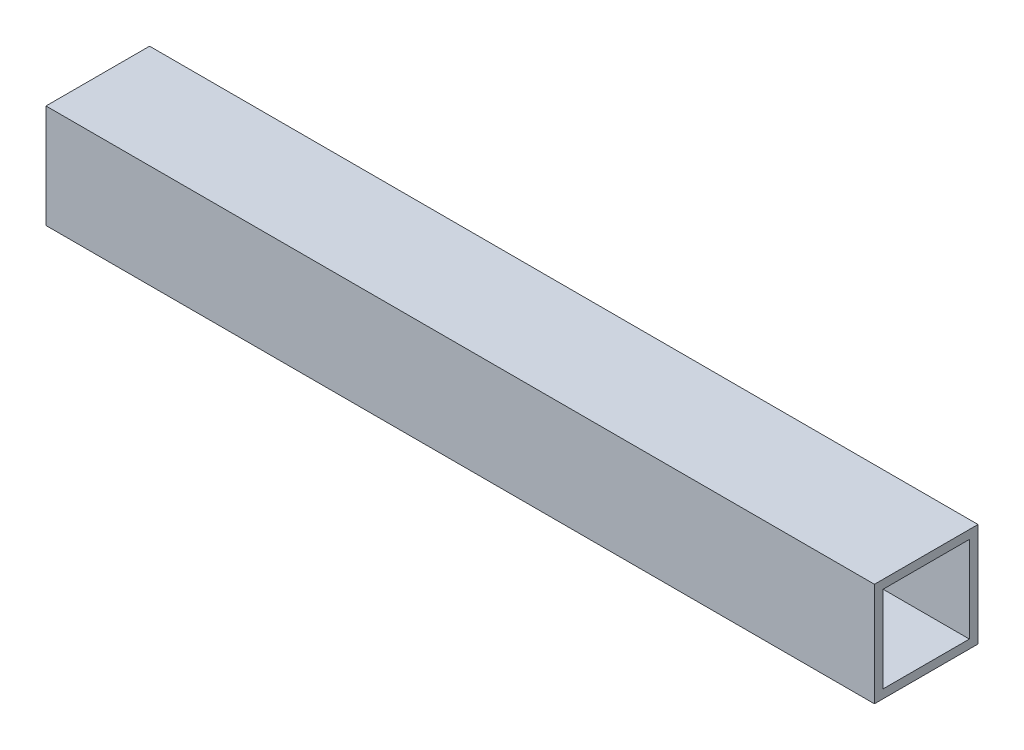
ISO-10303-21;
HEADER;
FILE_DESCRIPTION(('STEP AP214'),'2;1');
FILE_NAME('part.step','',(''),(''),'','','');
FILE_SCHEMA(('AUTOMOTIVE_DESIGN { 1 0 10303 214 1 1 1 1 }'));
ENDSEC;
DATA;
#1=APPLICATION_CONTEXT('core data for automotive mechanical design processes');
#2=APPLICATION_PROTOCOL_DEFINITION('international standard','automotive_design',2000,#1);
#3=PRODUCT_CONTEXT('',#1,'mechanical');
#4=PRODUCT('Part','Part','',(#3));
#5=PRODUCT_RELATED_PRODUCT_CATEGORY('part','',(#4));
#6=PRODUCT_DEFINITION_FORMATION('','',#4);
#7=PRODUCT_DEFINITION_CONTEXT('part definition',#1,'design');
#8=PRODUCT_DEFINITION('design','',#6,#7);
#9=PRODUCT_DEFINITION_SHAPE('','',#8);
#10=(LENGTH_UNIT() NAMED_UNIT(*) SI_UNIT(.MILLI.,.METRE.));
#11=(NAMED_UNIT(*) PLANE_ANGLE_UNIT() SI_UNIT($,.RADIAN.));
#12=(NAMED_UNIT(*) SI_UNIT($,.STERADIAN.) SOLID_ANGLE_UNIT());
#13=UNCERTAINTY_MEASURE_WITH_UNIT(LENGTH_MEASURE(1.E-05),#10,'distance_accuracy_value','');
#14=(GEOMETRIC_REPRESENTATION_CONTEXT(3) GLOBAL_UNCERTAINTY_ASSIGNED_CONTEXT((#13)) GLOBAL_UNIT_ASSIGNED_CONTEXT((#10,
#11,#12)) REPRESENTATION_CONTEXT('',''));
#15=CARTESIAN_POINT('',(0.,0.,0.));
#16=DIRECTION('',(0.,0.,1.));
#17=DIRECTION('',(1.,0.,0.));
#18=AXIS2_PLACEMENT_3D('',#15,#16,#17);
#19=CARTESIAN_POINT('',(-152.4,-19.05,19.05));
#20=DIRECTION('',(0.,-1.,0.));
#21=DIRECTION('',(0.,0.,-1.));
#22=AXIS2_PLACEMENT_3D('',#19,#20,#21);
#23=PLANE('',#22);
#24=DIRECTION('',(1.,0.,0.));
#25=VECTOR('',#24,1.);
#26=CARTESIAN_POINT('',(-152.4,-19.05,19.05));
#27=LINE('',#26,#25);
#28=CARTESIAN_POINT('',(-152.4,-19.05,19.05));
#29=VERTEX_POINT('',#28);
#30=CARTESIAN_POINT('',(152.4,-19.05,19.05));
#31=VERTEX_POINT('',#30);
#32=EDGE_CURVE('E114',#29,#31,#27,.T.);
#33=ORIENTED_EDGE('',*,*,#32,.F.);
#34=DIRECTION('',(0.,0.,-1.));
#35=VECTOR('',#34,1.);
#36=CARTESIAN_POINT('',(-152.4,-19.05,0.));
#37=LINE('',#36,#35);
#38=CARTESIAN_POINT('',(-152.4,-19.05,-19.05));
#39=VERTEX_POINT('',#38);
#40=EDGE_CURVE('E136',#29,#39,#37,.T.);
#41=ORIENTED_EDGE('',*,*,#40,.T.);
#42=DIRECTION('',(-1.,0.,0.));
#43=VECTOR('',#42,1.);
#44=CARTESIAN_POINT('',(-152.4,-19.05,-19.05));
#45=LINE('',#44,#43);
#46=CARTESIAN_POINT('',(152.4,-19.05,-19.05));
#47=VERTEX_POINT('',#46);
#48=EDGE_CURVE('E131',#47,#39,#45,.T.);
#49=ORIENTED_EDGE('',*,*,#48,.F.);
#50=DIRECTION('',(0.,0.,-1.));
#51=VECTOR('',#50,1.);
#52=CARTESIAN_POINT('',(152.4,-19.05,0.));
#53=LINE('',#52,#51);
#54=EDGE_CURVE('E106',#31,#47,#53,.T.);
#55=ORIENTED_EDGE('',*,*,#54,.F.);
#56=EDGE_LOOP('',(#33,#41,#49,#55));
#57=FACE_BOUND('',#56,.T.);
#58=ADVANCED_FACE('F17',(#57),#23,.T.);
#59=CARTESIAN_POINT('',(-152.4,15.875,-15.875));
#60=DIRECTION('',(0.,0.,1.));
#61=DIRECTION('',(1.,0.,0.));
#62=AXIS2_PLACEMENT_3D('',#59,#60,#61);
#63=PLANE('',#62);
#64=DIRECTION('',(1.,0.,0.));
#65=VECTOR('',#64,1.);
#66=CARTESIAN_POINT('',(-152.4,15.875,-15.875));
#67=LINE('',#66,#65);
#68=CARTESIAN_POINT('',(-152.4,15.875,-15.875));
#69=VERTEX_POINT('',#68);
#70=CARTESIAN_POINT('',(152.4,15.875,-15.875));
#71=VERTEX_POINT('',#70);
#72=EDGE_CURVE('E91',#69,#71,#67,.T.);
#73=ORIENTED_EDGE('',*,*,#72,.F.);
#74=DIRECTION('',(0.,1.,0.));
#75=VECTOR('',#74,1.);
#76=CARTESIAN_POINT('',(-152.4,0.,-15.875));
#77=LINE('',#76,#75);
#78=CARTESIAN_POINT('',(-152.4,-15.875,-15.875));
#79=VERTEX_POINT('',#78);
#80=EDGE_CURVE('E139',#69,#79,#77,.F.);
#81=ORIENTED_EDGE('',*,*,#80,.T.);
#82=DIRECTION('',(1.,0.,0.));
#83=VECTOR('',#82,1.);
#84=CARTESIAN_POINT('',(-152.4,-15.875,-15.875));
#85=LINE('',#84,#83);
#86=CARTESIAN_POINT('',(152.4,-15.875,-15.875));
#87=VERTEX_POINT('',#86);
#88=EDGE_CURVE('E20',#87,#79,#85,.F.);
#89=ORIENTED_EDGE('',*,*,#88,.F.);
#90=DIRECTION('',(0.,1.,0.));
#91=VECTOR('',#90,1.);
#92=CARTESIAN_POINT('',(152.4,0.,-15.875));
#93=LINE('',#92,#91);
#94=EDGE_CURVE('E105',#71,#87,#93,.F.);
#95=ORIENTED_EDGE('',*,*,#94,.F.);
#96=EDGE_LOOP('',(#73,#81,#89,#95));
#97=FACE_BOUND('',#96,.T.);
#98=ADVANCED_FACE('F125',(#97),#63,.T.);
#99=CARTESIAN_POINT('',(-152.4,-15.875,-15.875));
#100=DIRECTION('',(0.,1.,0.));
#101=DIRECTION('',(0.,0.,1.));
#102=AXIS2_PLACEMENT_3D('',#99,#100,#101);
#103=PLANE('',#102);
#104=ORIENTED_EDGE('',*,*,#88,.T.);
#105=DIRECTION('',(0.,0.,-1.));
#106=VECTOR('',#105,1.);
#107=CARTESIAN_POINT('',(-152.4,-15.875,0.));
#108=LINE('',#107,#106);
#109=CARTESIAN_POINT('',(-152.4,-15.875,15.875));
#110=VERTEX_POINT('',#109);
#111=EDGE_CURVE('E88',#79,#110,#108,.F.);
#112=ORIENTED_EDGE('',*,*,#111,.T.);
#113=DIRECTION('',(-1.,0.,0.));
#114=VECTOR('',#113,1.);
#115=CARTESIAN_POINT('',(-152.4,-15.875,15.875));
#116=LINE('',#115,#114);
#117=CARTESIAN_POINT('',(152.4,-15.875,15.875));
#118=VERTEX_POINT('',#117);
#119=EDGE_CURVE('E80',#118,#110,#116,.T.);
#120=ORIENTED_EDGE('',*,*,#119,.F.);
#121=DIRECTION('',(0.,0.,-1.));
#122=VECTOR('',#121,1.);
#123=CARTESIAN_POINT('',(152.4,-15.875,0.));
#124=LINE('',#123,#122);
#125=EDGE_CURVE('E85',#87,#118,#124,.F.);
#126=ORIENTED_EDGE('',*,*,#125,.F.);
#127=EDGE_LOOP('',(#104,#112,#120,#126));
#128=FACE_BOUND('',#127,.T.);
#129=ADVANCED_FACE('F83',(#128),#103,.T.);
#130=CARTESIAN_POINT('',(-152.4,-15.875,15.875));
#131=DIRECTION('',(0.,0.,-1.));
#132=DIRECTION('',(-1.,0.,0.));
#133=AXIS2_PLACEMENT_3D('',#130,#131,#132);
#134=PLANE('',#133);
#135=ORIENTED_EDGE('',*,*,#119,.T.);
#136=DIRECTION('',(0.,1.,0.));
#137=VECTOR('',#136,1.);
#138=CARTESIAN_POINT('',(-152.4,0.,15.875));
#139=LINE('',#138,#137);
#140=CARTESIAN_POINT('',(-152.4,15.875,15.875));
#141=VERTEX_POINT('',#140);
#142=EDGE_CURVE('E142',#110,#141,#139,.T.);
#143=ORIENTED_EDGE('',*,*,#142,.T.);
#144=DIRECTION('',(1.,0.,0.));
#145=VECTOR('',#144,1.);
#146=CARTESIAN_POINT('',(-152.4,15.875,15.875));
#147=LINE('',#146,#145);
#148=CARTESIAN_POINT('',(152.4,15.875,15.875));
#149=VERTEX_POINT('',#148);
#150=EDGE_CURVE('E96',#149,#141,#147,.F.);
#151=ORIENTED_EDGE('',*,*,#150,.F.);
#152=DIRECTION('',(0.,1.,0.));
#153=VECTOR('',#152,1.);
#154=CARTESIAN_POINT('',(152.4,0.,15.875));
#155=LINE('',#154,#153);
#156=EDGE_CURVE('E93',#118,#149,#155,.T.);
#157=ORIENTED_EDGE('',*,*,#156,.F.);
#158=EDGE_LOOP('',(#135,#143,#151,#157));
#159=FACE_BOUND('',#158,.T.);
#160=ADVANCED_FACE('F94',(#159),#134,.T.);
#161=CARTESIAN_POINT('',(-152.4,15.875,15.875));
#162=DIRECTION('',(0.,-1.,0.));
#163=DIRECTION('',(0.,0.,-1.));
#164=AXIS2_PLACEMENT_3D('',#161,#162,#163);
#165=PLANE('',#164);
#166=ORIENTED_EDGE('',*,*,#150,.T.);
#167=DIRECTION('',(0.,0.,-1.));
#168=VECTOR('',#167,1.);
#169=CARTESIAN_POINT('',(-152.4,15.875,0.));
#170=LINE('',#169,#168);
#171=EDGE_CURVE('E122',#141,#69,#170,.T.);
#172=ORIENTED_EDGE('',*,*,#171,.T.);
#173=ORIENTED_EDGE('',*,*,#72,.T.);
#174=DIRECTION('',(0.,0.,-1.));
#175=VECTOR('',#174,1.);
#176=CARTESIAN_POINT('',(152.4,15.875,0.));
#177=LINE('',#176,#175);
#178=EDGE_CURVE('E100',#149,#71,#177,.T.);
#179=ORIENTED_EDGE('',*,*,#178,.F.);
#180=EDGE_LOOP('',(#166,#172,#173,#179));
#181=FACE_BOUND('',#180,.T.);
#182=ADVANCED_FACE('F120',(#181),#165,.T.);
#183=CARTESIAN_POINT('',(-152.4,19.05,19.05));
#184=DIRECTION('',(0.,0.,1.));
#185=DIRECTION('',(1.,0.,0.));
#186=AXIS2_PLACEMENT_3D('',#183,#184,#185);
#187=PLANE('',#186);
#188=DIRECTION('',(1.,0.,0.));
#189=VECTOR('',#188,1.);
#190=CARTESIAN_POINT('',(-152.4,19.05,19.05));
#191=LINE('',#190,#189);
#192=CARTESIAN_POINT('',(-152.4,19.05,19.05));
#193=VERTEX_POINT('',#192);
#194=CARTESIAN_POINT('',(152.4,19.05,19.05));
#195=VERTEX_POINT('',#194);
#196=EDGE_CURVE('E145',#193,#195,#191,.T.);
#197=ORIENTED_EDGE('',*,*,#196,.F.);
#198=DIRECTION('',(0.,1.,0.));
#199=VECTOR('',#198,1.);
#200=CARTESIAN_POINT('',(-152.4,0.,19.05));
#201=LINE('',#200,#199);
#202=EDGE_CURVE('E133',#193,#29,#201,.F.);
#203=ORIENTED_EDGE('',*,*,#202,.T.);
#204=ORIENTED_EDGE('',*,*,#32,.T.);
#205=DIRECTION('',(0.,1.,0.));
#206=VECTOR('',#205,1.);
#207=CARTESIAN_POINT('',(152.4,0.,19.05));
#208=LINE('',#207,#206);
#209=EDGE_CURVE('E108',#195,#31,#208,.F.);
#210=ORIENTED_EDGE('',*,*,#209,.F.);
#211=EDGE_LOOP('',(#197,#203,#204,#210));
#212=FACE_BOUND('',#211,.T.);
#213=ADVANCED_FACE('F164',(#212),#187,.T.);
#214=CARTESIAN_POINT('',(152.4,0.,0.));
#215=DIRECTION('',(1.,0.,0.));
#216=DIRECTION('',(0.,0.,-1.));
#217=AXIS2_PLACEMENT_3D('',#214,#215,#216);
#218=PLANE('',#217);
#219=ORIENTED_EDGE('',*,*,#178,.T.);
#220=ORIENTED_EDGE('',*,*,#94,.T.);
#221=ORIENTED_EDGE('',*,*,#125,.T.);
#222=ORIENTED_EDGE('',*,*,#156,.T.);
#223=EDGE_LOOP('',(#219,#220,#221,#222));
#224=FACE_BOUND('',#223,.T.);
#225=DIRECTION('',(0.,1.,0.));
#226=VECTOR('',#225,1.);
#227=CARTESIAN_POINT('',(152.4,-19.05,-19.05));
#228=LINE('',#227,#226);
#229=CARTESIAN_POINT('',(152.4,19.05,-19.05));
#230=VERTEX_POINT('',#229);
#231=EDGE_CURVE('E126',#230,#47,#228,.F.);
#232=ORIENTED_EDGE('',*,*,#231,.F.);
#233=DIRECTION('',(0.,0.,1.));
#234=VECTOR('',#233,1.);
#235=CARTESIAN_POINT('',(152.4,19.05,-19.05));
#236=LINE('',#235,#234);
#237=EDGE_CURVE('E148',#195,#230,#236,.F.);
#238=ORIENTED_EDGE('',*,*,#237,.F.);
#239=ORIENTED_EDGE('',*,*,#209,.T.);
#240=ORIENTED_EDGE('',*,*,#54,.T.);
#241=EDGE_LOOP('',(#232,#238,#239,#240));
#242=FACE_BOUND('',#241,.T.);
#243=ADVANCED_FACE('F102',(#224,#242),#218,.T.);
#244=CARTESIAN_POINT('',(-152.4,-19.05,-19.05));
#245=DIRECTION('',(0.,0.,-1.));
#246=DIRECTION('',(-1.,0.,0.));
#247=AXIS2_PLACEMENT_3D('',#244,#245,#246);
#248=PLANE('',#247);
#249=ORIENTED_EDGE('',*,*,#48,.T.);
#250=DIRECTION('',(0.,1.,0.));
#251=VECTOR('',#250,1.);
#252=CARTESIAN_POINT('',(-152.4,0.,-19.05));
#253=LINE('',#252,#251);
#254=CARTESIAN_POINT('',(-152.4,19.05,-19.05));
#255=VERTEX_POINT('',#254);
#256=EDGE_CURVE('E35',#39,#255,#253,.T.);
#257=ORIENTED_EDGE('',*,*,#256,.T.);
#258=DIRECTION('',(1.,0.,0.));
#259=VECTOR('',#258,1.);
#260=CARTESIAN_POINT('',(-152.4,19.05,-19.05));
#261=LINE('',#260,#259);
#262=EDGE_CURVE('E26',#230,#255,#261,.F.);
#263=ORIENTED_EDGE('',*,*,#262,.F.);
#264=ORIENTED_EDGE('',*,*,#231,.T.);
#265=EDGE_LOOP('',(#249,#257,#263,#264));
#266=FACE_BOUND('',#265,.T.);
#267=ADVANCED_FACE('F155',(#266),#248,.T.);
#268=CARTESIAN_POINT('',(-152.4,0.,0.));
#269=DIRECTION('',(1.,0.,0.));
#270=DIRECTION('',(0.,0.,-1.));
#271=AXIS2_PLACEMENT_3D('',#268,#269,#270);
#272=PLANE('',#271);
#273=ORIENTED_EDGE('',*,*,#142,.F.);
#274=ORIENTED_EDGE('',*,*,#111,.F.);
#275=ORIENTED_EDGE('',*,*,#80,.F.);
#276=ORIENTED_EDGE('',*,*,#171,.F.);
#277=EDGE_LOOP('',(#273,#274,#275,#276));
#278=FACE_BOUND('',#277,.T.);
#279=ORIENTED_EDGE('',*,*,#40,.F.);
#280=ORIENTED_EDGE('',*,*,#202,.F.);
#281=DIRECTION('',(0.,0.,1.));
#282=VECTOR('',#281,1.);
#283=CARTESIAN_POINT('',(-152.4,19.05,-19.05));
#284=LINE('',#283,#282);
#285=EDGE_CURVE('E11',#255,#193,#284,.T.);
#286=ORIENTED_EDGE('',*,*,#285,.F.);
#287=ORIENTED_EDGE('',*,*,#256,.F.);
#288=EDGE_LOOP('',(#279,#280,#286,#287));
#289=FACE_BOUND('',#288,.T.);
#290=ADVANCED_FACE('F162',(#278,#289),#272,.F.);
#291=CARTESIAN_POINT('',(-152.4,19.05,-19.05));
#292=DIRECTION('',(0.,1.,0.));
#293=DIRECTION('',(0.,0.,1.));
#294=AXIS2_PLACEMENT_3D('',#291,#292,#293);
#295=PLANE('',#294);
#296=ORIENTED_EDGE('',*,*,#262,.T.);
#297=ORIENTED_EDGE('',*,*,#285,.T.);
#298=ORIENTED_EDGE('',*,*,#196,.T.);
#299=ORIENTED_EDGE('',*,*,#237,.T.);
#300=EDGE_LOOP('',(#296,#297,#298,#299));
#301=FACE_BOUND('',#300,.T.);
#302=ADVANCED_FACE('F153',(#301),#295,.T.);
#303=CLOSED_SHELL('',(#58,#98,#129,#160,#182,#213,#243,#267,#290,#302));
#304=MANIFOLD_SOLID_BREP('B1',#303);
#305=ADVANCED_BREP_SHAPE_REPRESENTATION('',(#18,#304),#14);
#306=SHAPE_DEFINITION_REPRESENTATION(#9,#305);
ENDSEC;
END-ISO-10303-21;
